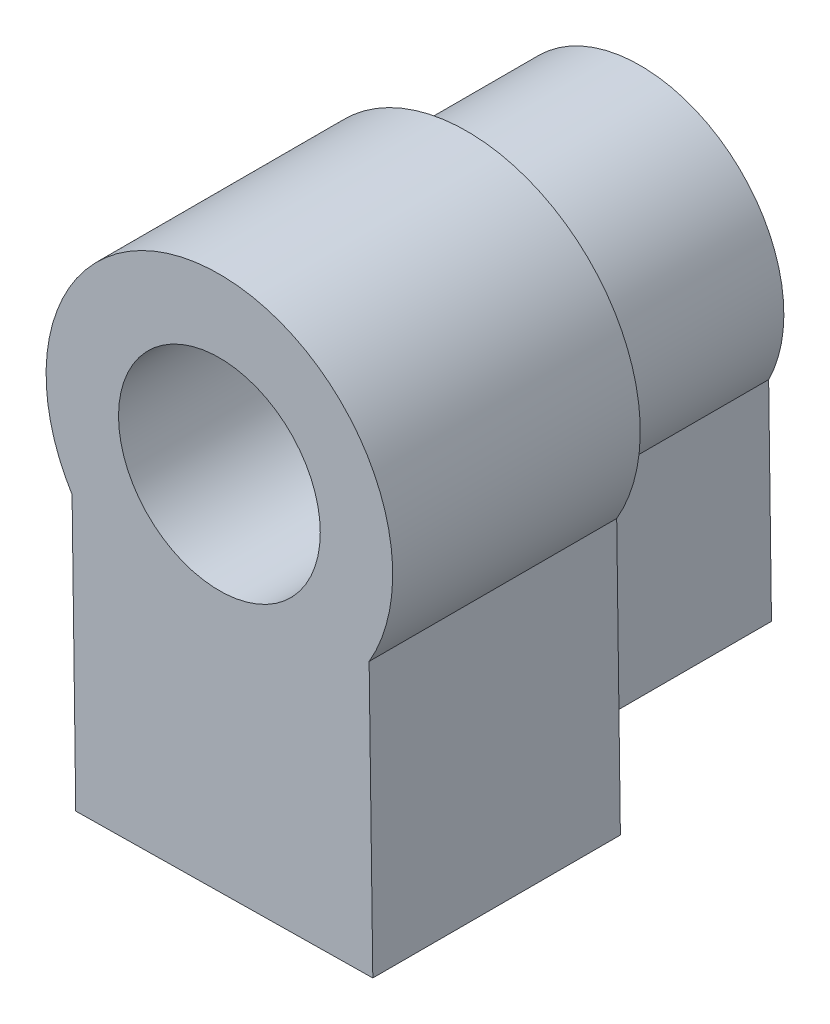
ISO-10303-21;
HEADER;
FILE_DESCRIPTION(('STEP AP214'),'2;1');
FILE_NAME('part.step','',(''),(''),'','','');
FILE_SCHEMA(('AUTOMOTIVE_DESIGN { 1 0 10303 214 1 1 1 1 }'));
ENDSEC;
DATA;
#1=APPLICATION_CONTEXT('core data for automotive mechanical design processes');
#2=APPLICATION_PROTOCOL_DEFINITION('international standard','automotive_design',2000,#1);
#3=PRODUCT_CONTEXT('',#1,'mechanical');
#4=PRODUCT('Part','Part','',(#3));
#5=PRODUCT_RELATED_PRODUCT_CATEGORY('part','',(#4));
#6=PRODUCT_DEFINITION_FORMATION('','',#4);
#7=PRODUCT_DEFINITION_CONTEXT('part definition',#1,'design');
#8=PRODUCT_DEFINITION('design','',#6,#7);
#9=PRODUCT_DEFINITION_SHAPE('','',#8);
#10=(LENGTH_UNIT() NAMED_UNIT(*) SI_UNIT(.MILLI.,.METRE.));
#11=(NAMED_UNIT(*) PLANE_ANGLE_UNIT() SI_UNIT($,.RADIAN.));
#12=(NAMED_UNIT(*) SI_UNIT($,.STERADIAN.) SOLID_ANGLE_UNIT());
#13=UNCERTAINTY_MEASURE_WITH_UNIT(LENGTH_MEASURE(1.E-05),#10,'distance_accuracy_value','');
#14=(GEOMETRIC_REPRESENTATION_CONTEXT(3) GLOBAL_UNCERTAINTY_ASSIGNED_CONTEXT((#13)) GLOBAL_UNIT_ASSIGNED_CONTEXT((#10,
#11,#12)) REPRESENTATION_CONTEXT('',''));
#15=CARTESIAN_POINT('',(0.,0.,0.));
#16=DIRECTION('',(0.,0.,1.));
#17=DIRECTION('',(1.,0.,0.));
#18=AXIS2_PLACEMENT_3D('',#15,#16,#17);
#19=CARTESIAN_POINT('',(4.98687572108652,0.0674471299078353,7.));
#20=DIRECTION('',(0.999908550721291,0.0135236901195044,0.));
#21=DIRECTION('',(-0.0135236901195044,0.999908550721291,0.));
#22=AXIS2_PLACEMENT_3D('',#19,#20,#21);
#23=PLANE('',#22);
#24=DIRECTION('',(0.0135236901195044,-0.999908550721291,0.));
#25=VECTOR('',#24,1.);
#26=CARTESIAN_POINT('',(4.98687572108652,0.0674471299078353,0.));
#27=LINE('',#26,#25);
#28=CARTESIAN_POINT('',(5.05045283259864,-4.63328890214981,0.));
#29=VERTEX_POINT('',#28);
#30=CARTESIAN_POINT('',(5.16406221909893,-13.0332889021498,0.));
#31=VERTEX_POINT('',#30);
#32=EDGE_CURVE('E117',#29,#31,#27,.T.);
#33=ORIENTED_EDGE('',*,*,#32,.F.);
#34=DIRECTION('',(0.,0.,-1.));
#35=VECTOR('',#34,1.);
#36=CARTESIAN_POINT('',(5.05045283259864,-4.63328890214981,7.));
#37=LINE('',#36,#35);
#38=CARTESIAN_POINT('',(5.05045283259864,-4.63328890214981,7.));
#39=VERTEX_POINT('',#38);
#40=EDGE_CURVE('E45',#39,#29,#37,.T.);
#41=ORIENTED_EDGE('',*,*,#40,.F.);
#42=DIRECTION('',(0.0135236901195044,-0.999908550721291,0.));
#43=VECTOR('',#42,1.);
#44=CARTESIAN_POINT('',(4.98687572108652,0.0674471299078353,7.));
#45=LINE('',#44,#43);
#46=CARTESIAN_POINT('',(5.16406221909893,-13.0332889021498,7.));
#47=VERTEX_POINT('',#46);
#48=EDGE_CURVE('E157',#39,#47,#45,.T.);
#49=ORIENTED_EDGE('',*,*,#48,.T.);
#50=DIRECTION('',(0.,0.,-1.));
#51=VECTOR('',#50,1.);
#52=CARTESIAN_POINT('',(5.16406221909893,-13.0332889021498,7.));
#53=LINE('',#52,#51);
#54=EDGE_CURVE('E75',#47,#31,#53,.T.);
#55=ORIENTED_EDGE('',*,*,#54,.T.);
#56=EDGE_LOOP('',(#33,#41,#49,#55));
#57=FACE_BOUND('',#56,.T.);
#58=ADVANCED_FACE('F37',(#57),#23,.T.);
#59=CARTESIAN_POINT('',(-0.135614238952738,-2.03623127295278,7.));
#60=DIRECTION('',(0.,0.,-1.));
#61=DIRECTION('',(-1.,0.,0.));
#62=AXIS2_PLACEMENT_3D('',#59,#60,#61);
#63=CYLINDRICAL_SURFACE('',#62,5.8);
#64=CARTESIAN_POINT('',(-0.135614238952738,-2.03623127295278,0.));
#65=DIRECTION('',(0.,0.,1.));
#66=DIRECTION('',(1.,0.,0.));
#67=AXIS2_PLACEMENT_3D('',#64,#65,#66);
#68=CIRCLE('',#67,5.8);
#69=CARTESIAN_POINT('',(-5.24954716740136,-4.77259564988231,0.));
#70=VERTEX_POINT('',#69);
#71=EDGE_CURVE('E171',#29,#70,#68,.T.);
#72=ORIENTED_EDGE('',*,*,#71,.T.);
#73=DIRECTION('',(0.,0.,-1.));
#74=VECTOR('',#73,1.);
#75=CARTESIAN_POINT('',(-5.24954716740136,-4.77259564988231,7.));
#76=LINE('',#75,#74);
#77=CARTESIAN_POINT('',(-5.24954716740136,-4.77259564988231,7.));
#78=VERTEX_POINT('',#77);
#79=EDGE_CURVE('E177',#78,#70,#76,.T.);
#80=ORIENTED_EDGE('',*,*,#79,.F.);
#81=CARTESIAN_POINT('',(-0.135614238952738,-2.03623127295278,7.));
#82=DIRECTION('',(0.,0.,1.));
#83=DIRECTION('',(1.,0.,0.));
#84=AXIS2_PLACEMENT_3D('',#81,#82,#83);
#85=CIRCLE('',#84,5.8);
#86=EDGE_CURVE('E159',#39,#78,#85,.T.);
#87=ORIENTED_EDGE('',*,*,#86,.F.);
#88=ORIENTED_EDGE('',*,*,#40,.T.);
#89=EDGE_LOOP('',(#72,#80,#87,#88));
#90=FACE_BOUND('',#89,.T.);
#91=ADVANCED_FACE('F180',(#90),#63,.T.);
#92=CARTESIAN_POINT('',(-5.31312427891349,-0.0718596178246598,7.));
#93=DIRECTION('',(0.999908550721291,0.0135236901195044,0.));
#94=DIRECTION('',(-0.0135236901195044,0.999908550721291,0.));
#95=AXIS2_PLACEMENT_3D('',#92,#93,#94);
#96=PLANE('',#95);
#97=DIRECTION('',(0.0135236901195044,-0.999908550721291,0.));
#98=VECTOR('',#97,1.);
#99=CARTESIAN_POINT('',(-5.31312427891349,-0.0718596178246598,0.));
#100=LINE('',#99,#98);
#101=CARTESIAN_POINT('',(-5.13593778090107,-13.1725956498823,0.));
#102=VERTEX_POINT('',#101);
#103=EDGE_CURVE('E69',#70,#102,#100,.T.);
#104=ORIENTED_EDGE('',*,*,#103,.T.);
#105=DIRECTION('',(0.,0.,-1.));
#106=VECTOR('',#105,1.);
#107=CARTESIAN_POINT('',(-5.13593778090107,-13.1725956498823,7.));
#108=LINE('',#107,#106);
#109=CARTESIAN_POINT('',(-5.13593778090107,-13.1725956498823,7.));
#110=VERTEX_POINT('',#109);
#111=EDGE_CURVE('E53',#110,#102,#108,.T.);
#112=ORIENTED_EDGE('',*,*,#111,.F.);
#113=DIRECTION('',(0.0135236901195044,-0.999908550721291,0.));
#114=VECTOR('',#113,1.);
#115=CARTESIAN_POINT('',(-5.31312427891349,-0.0718596178246598,7.));
#116=LINE('',#115,#114);
#117=EDGE_CURVE('E163',#78,#110,#116,.T.);
#118=ORIENTED_EDGE('',*,*,#117,.F.);
#119=ORIENTED_EDGE('',*,*,#79,.T.);
#120=EDGE_LOOP('',(#104,#112,#118,#119));
#121=FACE_BOUND('',#120,.T.);
#122=ADVANCED_FACE('F189',(#121),#96,.F.);
#123=CARTESIAN_POINT('',(0.177186498012413,-13.1007360320577,7.));
#124=DIRECTION('',(-0.0135236901195044,0.999908550721291,0.));
#125=DIRECTION('',(-0.999908550721291,-0.0135236901195044,0.));
#126=AXIS2_PLACEMENT_3D('',#123,#124,#125);
#127=PLANE('',#126);
#128=DIRECTION('',(0.999908550721291,0.0135236901195044,0.));
#129=VECTOR('',#128,1.);
#130=CARTESIAN_POINT('',(0.177186498012413,-13.1007360320577,0.));
#131=LINE('',#130,#129);
#132=EDGE_CURVE('E160',#102,#31,#131,.T.);
#133=ORIENTED_EDGE('',*,*,#132,.T.);
#134=ORIENTED_EDGE('',*,*,#54,.F.);
#135=DIRECTION('',(0.999908550721291,0.0135236901195044,0.));
#136=VECTOR('',#135,1.);
#137=CARTESIAN_POINT('',(0.177186498012413,-13.1007360320577,7.));
#138=LINE('',#137,#136);
#139=EDGE_CURVE('E166',#110,#47,#138,.T.);
#140=ORIENTED_EDGE('',*,*,#139,.F.);
#141=ORIENTED_EDGE('',*,*,#111,.T.);
#142=EDGE_LOOP('',(#133,#134,#140,#141));
#143=FACE_BOUND('',#142,.T.);
#144=ADVANCED_FACE('F193',(#143),#127,.F.);
#145=CARTESIAN_POINT('',(0.,0.,0.));
#146=DIRECTION('',(0.,0.,1.));
#147=DIRECTION('',(1.,0.,0.));
#148=AXIS2_PLACEMENT_3D('',#145,#146,#147);
#149=PLANE('',#148);
#150=ORIENTED_EDGE('',*,*,#32,.T.);
#151=ORIENTED_EDGE('',*,*,#132,.F.);
#152=ORIENTED_EDGE('',*,*,#103,.F.);
#153=ORIENTED_EDGE('',*,*,#71,.F.);
#154=EDGE_LOOP('',(#150,#151,#152,#153));
#155=FACE_BOUND('',#154,.T.);
#156=ADVANCED_FACE('F183',(#155),#149,.F.);
#157=CARTESIAN_POINT('',(5.83632702541427,0.0789358967585737,17.));
#158=DIRECTION('',(0.999908550721291,0.0135236901194974,0.));
#159=DIRECTION('',(-0.0135236901194974,0.999908550721291,0.));
#160=AXIS2_PLACEMENT_3D('',#157,#158,#159);
#161=PLANE('',#160);
#162=DIRECTION('',(0.0135236901194974,-0.999908550721291,0.));
#163=VECTOR('',#162,1.);
#164=CARTESIAN_POINT('',(5.83632702541427,0.0789358967585737,7.));
#165=LINE('',#164,#163);
#166=CARTESIAN_POINT('',(5.91259742353434,-5.5603106826363,7.));
#167=VERTEX_POINT('',#166);
#168=CARTESIAN_POINT('',(6.06137162014178,-16.5603106826363,7.));
#169=VERTEX_POINT('',#168);
#170=EDGE_CURVE('E114',#167,#169,#165,.T.);
#171=ORIENTED_EDGE('',*,*,#170,.F.);
#172=DIRECTION('',(0.,0.,-1.));
#173=VECTOR('',#172,1.);
#174=CARTESIAN_POINT('',(5.91259742353434,-5.5603106826363,17.));
#175=LINE('',#174,#173);
#176=CARTESIAN_POINT('',(5.91259742353434,-5.5603106826363,17.));
#177=VERTEX_POINT('',#176);
#178=EDGE_CURVE('E107',#177,#167,#175,.T.);
#179=ORIENTED_EDGE('',*,*,#178,.F.);
#180=DIRECTION('',(0.0135236901194974,-0.999908550721291,0.));
#181=VECTOR('',#180,1.);
#182=CARTESIAN_POINT('',(5.83632702541427,0.0789358967585737,17.));
#183=LINE('',#182,#181);
#184=CARTESIAN_POINT('',(6.06137162014178,-16.5603106826363,17.));
#185=VERTEX_POINT('',#184);
#186=EDGE_CURVE('E111',#177,#185,#183,.T.);
#187=ORIENTED_EDGE('',*,*,#186,.T.);
#188=DIRECTION('',(0.,0.,-1.));
#189=VECTOR('',#188,1.);
#190=CARTESIAN_POINT('',(6.06137162014178,-16.5603106826363,17.));
#191=LINE('',#190,#189);
#192=EDGE_CURVE('E146',#185,#169,#191,.T.);
#193=ORIENTED_EDGE('',*,*,#192,.T.);
#194=EDGE_LOOP('',(#171,#179,#187,#193));
#195=FACE_BOUND('',#194,.T.);
#196=ADVANCED_FACE('F109',(#195),#161,.T.);
#197=CARTESIAN_POINT('',(-0.135614238952738,-2.03623127295278,17.));
#198=DIRECTION('',(0.,0.,-1.));
#199=DIRECTION('',(-1.,0.,0.));
#200=AXIS2_PLACEMENT_3D('',#197,#198,#199);
#201=CYLINDRICAL_SURFACE('',#200,7.);
#202=CARTESIAN_POINT('',(-0.135614238952738,-2.03623127295278,7.));
#203=DIRECTION('',(0.,0.,1.));
#204=DIRECTION('',(1.,0.,0.));
#205=AXIS2_PLACEMENT_3D('',#202,#203,#204);
#206=CIRCLE('',#205,7.);
#207=CARTESIAN_POINT('',(-6.08630518512115,-5.72259496407026,7.));
#208=VERTEX_POINT('',#207);
#209=EDGE_CURVE('E148',#167,#208,#206,.T.);
#210=ORIENTED_EDGE('',*,*,#209,.T.);
#211=DIRECTION('',(0.,0.,-1.));
#212=VECTOR('',#211,1.);
#213=CARTESIAN_POINT('',(-6.08630518512115,-5.72259496407026,17.));
#214=LINE('',#213,#212);
#215=CARTESIAN_POINT('',(-6.08630518512115,-5.72259496407026,17.));
#216=VERTEX_POINT('',#215);
#217=EDGE_CURVE('E118',#216,#208,#214,.T.);
#218=ORIENTED_EDGE('',*,*,#217,.F.);
#219=CARTESIAN_POINT('',(-0.135614238952738,-2.03623127295278,17.));
#220=DIRECTION('',(0.,0.,1.));
#221=DIRECTION('',(1.,0.,0.));
#222=AXIS2_PLACEMENT_3D('',#219,#220,#221);
#223=CIRCLE('',#222,7.);
#224=EDGE_CURVE('E121',#177,#216,#223,.T.);
#225=ORIENTED_EDGE('',*,*,#224,.F.);
#226=ORIENTED_EDGE('',*,*,#178,.T.);
#227=EDGE_LOOP('',(#210,#218,#225,#226));
#228=FACE_BOUND('',#227,.T.);
#229=ADVANCED_FACE('F122',(#228),#201,.T.);
#230=CARTESIAN_POINT('',(-6.16257558324121,-0.0833483846753965,17.));
#231=DIRECTION('',(0.999908550721291,0.0135236901194976,0.));
#232=DIRECTION('',(-0.0135236901194976,0.999908550721291,0.));
#233=AXIS2_PLACEMENT_3D('',#230,#231,#232);
#234=PLANE('',#233);
#235=DIRECTION('',(0.0135236901194976,-0.999908550721291,0.));
#236=VECTOR('',#235,1.);
#237=CARTESIAN_POINT('',(-6.16257558324121,-0.0833483846753965,7.));
#238=LINE('',#237,#236);
#239=CARTESIAN_POINT('',(-5.9375309885137,-16.7225949640703,7.));
#240=VERTEX_POINT('',#239);
#241=EDGE_CURVE('E135',#208,#240,#238,.T.);
#242=ORIENTED_EDGE('',*,*,#241,.T.);
#243=DIRECTION('',(0.,0.,-1.));
#244=VECTOR('',#243,1.);
#245=CARTESIAN_POINT('',(-5.9375309885137,-16.7225949640703,17.));
#246=LINE('',#245,#244);
#247=CARTESIAN_POINT('',(-5.9375309885137,-16.7225949640703,17.));
#248=VERTEX_POINT('',#247);
#249=EDGE_CURVE('E154',#248,#240,#246,.T.);
#250=ORIENTED_EDGE('',*,*,#249,.F.);
#251=DIRECTION('',(0.0135236901194976,-0.999908550721291,0.));
#252=VECTOR('',#251,1.);
#253=CARTESIAN_POINT('',(-6.16257558324121,-0.0833483846753965,17.));
#254=LINE('',#253,#252);
#255=EDGE_CURVE('E126',#216,#248,#254,.T.);
#256=ORIENTED_EDGE('',*,*,#255,.F.);
#257=ORIENTED_EDGE('',*,*,#217,.T.);
#258=EDGE_LOOP('',(#242,#250,#256,#257));
#259=FACE_BOUND('',#258,.T.);
#260=ADVANCED_FACE('F211',(#259),#234,.F.);
#261=CARTESIAN_POINT('',(0.225044594727508,-16.6392465793949,17.));
#262=DIRECTION('',(0.0135236901194974,-0.999908550721291,0.));
#263=DIRECTION('',(0.999908550721291,0.0135236901194974,0.));
#264=AXIS2_PLACEMENT_3D('',#261,#262,#263);
#265=PLANE('',#264);
#266=CARTESIAN_POINT('',(-0.0160965838409271,-16.6425079962231,13.));
#267=DIRECTION('',(0.0135236901194975,-0.999908550721291,0.));
#268=DIRECTION('',(0.999908550721291,0.0135236901194975,0.));
#269=AXIS2_PLACEMENT_3D('',#266,#267,#268);
#270=CIRCLE('',#269,1.35);
#271=CARTESIAN_POINT('',(1.33377995963282,-16.6242510145618,13.));
#272=VERTEX_POINT('',#271);
#273=EDGE_CURVE('E138',#272,#272,#270,.T.);
#274=ORIENTED_EDGE('',*,*,#273,.F.);
#275=EDGE_LOOP('',(#274));
#276=FACE_BOUND('',#275,.T.);
#277=DIRECTION('',(-0.999908550721291,-0.0135236901194974,0.));
#278=VECTOR('',#277,1.);
#279=CARTESIAN_POINT('',(0.225044594727508,-16.6392465793949,7.));
#280=LINE('',#279,#278);
#281=EDGE_CURVE('E132',#169,#240,#280,.T.);
#282=ORIENTED_EDGE('',*,*,#281,.F.);
#283=ORIENTED_EDGE('',*,*,#192,.F.);
#284=DIRECTION('',(-0.999908550721291,-0.0135236901194974,0.));
#285=VECTOR('',#284,1.);
#286=CARTESIAN_POINT('',(0.225044594727508,-16.6392465793949,17.));
#287=LINE('',#286,#285);
#288=EDGE_CURVE('E131',#185,#248,#287,.T.);
#289=ORIENTED_EDGE('',*,*,#288,.T.);
#290=ORIENTED_EDGE('',*,*,#249,.T.);
#291=EDGE_LOOP('',(#282,#283,#289,#290));
#292=FACE_BOUND('',#291,.T.);
#293=ADVANCED_FACE('F214',(#276,#292),#265,.T.);
#294=CARTESIAN_POINT('',(-0.135614238952738,-2.03623127295278,17.));
#295=DIRECTION('',(0.,0.,-1.));
#296=DIRECTION('',(-1.,0.,0.));
#297=AXIS2_PLACEMENT_3D('',#294,#295,#296);
#298=CYLINDRICAL_SURFACE('',#297,4.075);
#299=CARTESIAN_POINT('',(-0.135614238952738,-2.03623127295278,17.));
#300=DIRECTION('',(0.,0.,1.));
#301=DIRECTION('',(1.,0.,0.));
#302=AXIS2_PLACEMENT_3D('',#299,#300,#301);
#303=CIRCLE('',#302,4.075);
#304=CARTESIAN_POINT('',(3.93938576104726,-2.03623127295278,17.));
#305=VERTEX_POINT('',#304);
#306=EDGE_CURVE('E143',#305,#305,#303,.T.);
#307=ORIENTED_EDGE('',*,*,#306,.T.);
#308=EDGE_LOOP('',(#307));
#309=FACE_BOUND('',#308,.T.);
#310=CARTESIAN_POINT('',(-0.135614238952738,-2.03623127295278,7.));
#311=DIRECTION('',(0.,0.,1.));
#312=DIRECTION('',(1.,0.,0.));
#313=AXIS2_PLACEMENT_3D('',#310,#311,#312);
#314=CIRCLE('',#313,4.075);
#315=CARTESIAN_POINT('',(3.93938576104726,-2.03623127295278,7.));
#316=VERTEX_POINT('',#315);
#317=EDGE_CURVE('E11',#316,#316,#314,.F.);
#318=ORIENTED_EDGE('',*,*,#317,.T.);
#319=EDGE_LOOP('',(#318));
#320=FACE_BOUND('',#319,.T.);
#321=ADVANCED_FACE('F218',(#309,#320),#298,.F.);
#322=CARTESIAN_POINT('',(0.,0.,17.));
#323=DIRECTION('',(0.,0.,1.));
#324=DIRECTION('',(1.,0.,0.));
#325=AXIS2_PLACEMENT_3D('',#322,#323,#324);
#326=PLANE('',#325);
#327=ORIENTED_EDGE('',*,*,#186,.F.);
#328=ORIENTED_EDGE('',*,*,#224,.T.);
#329=ORIENTED_EDGE('',*,*,#255,.T.);
#330=ORIENTED_EDGE('',*,*,#288,.F.);
#331=EDGE_LOOP('',(#327,#328,#329,#330));
#332=FACE_BOUND('',#331,.T.);
#333=ORIENTED_EDGE('',*,*,#306,.F.);
#334=EDGE_LOOP('',(#333));
#335=FACE_BOUND('',#334,.T.);
#336=ADVANCED_FACE('F128',(#332,#335),#326,.T.);
#337=CARTESIAN_POINT('',(0.,0.,7.));
#338=DIRECTION('',(0.,0.,1.));
#339=DIRECTION('',(1.,0.,0.));
#340=AXIS2_PLACEMENT_3D('',#337,#338,#339);
#341=PLANE('',#340);
#342=ORIENTED_EDGE('',*,*,#48,.F.);
#343=ORIENTED_EDGE('',*,*,#86,.T.);
#344=ORIENTED_EDGE('',*,*,#117,.T.);
#345=ORIENTED_EDGE('',*,*,#139,.T.);
#346=EDGE_LOOP('',(#342,#343,#344,#345));
#347=FACE_BOUND('',#346,.T.);
#348=ORIENTED_EDGE('',*,*,#170,.T.);
#349=ORIENTED_EDGE('',*,*,#281,.T.);
#350=ORIENTED_EDGE('',*,*,#241,.F.);
#351=ORIENTED_EDGE('',*,*,#209,.F.);
#352=EDGE_LOOP('',(#348,#349,#350,#351));
#353=FACE_BOUND('',#352,.T.);
#354=ADVANCED_FACE('F205',(#347,#353),#341,.F.);
#355=CARTESIAN_POINT('',(0.,0.,7.));
#356=DIRECTION('',(0.,0.,1.));
#357=DIRECTION('',(1.,0.,0.));
#358=AXIS2_PLACEMENT_3D('',#355,#356,#357);
#359=PLANE('',#358);
#360=ORIENTED_EDGE('',*,*,#317,.F.);
#361=EDGE_LOOP('',(#360));
#362=FACE_BOUND('',#361,.T.);
#363=ADVANCED_FACE('F201',(#362),#359,.T.);
#364=CARTESIAN_POINT('',(-0.131047949856656,-8.14328531509213,13.));
#365=DIRECTION('',(0.0135236901194975,-0.99990855072129,0.));
#366=DIRECTION('',(0.999908550721291,0.0135236901194975,0.));
#367=AXIS2_PLACEMENT_3D('',#364,#365,#366);
#368=CYLINDRICAL_SURFACE('',#367,1.35);
#369=CARTESIAN_POINT('',(-0.131047949856656,-8.14328531509213,13.));
#370=DIRECTION('',(0.0135236901194975,-0.999908550721291,0.));
#371=DIRECTION('',(0.999908550721291,0.0135236901194975,0.));
#372=AXIS2_PLACEMENT_3D('',#369,#370,#371);
#373=CIRCLE('',#372,1.35);
#374=CARTESIAN_POINT('',(1.21882859361709,-8.12502833343081,13.));
#375=VERTEX_POINT('',#374);
#376=EDGE_CURVE('E149',#375,#375,#373,.T.);
#377=ORIENTED_EDGE('',*,*,#376,.F.);
#378=EDGE_LOOP('',(#377));
#379=FACE_BOUND('',#378,.T.);
#380=ORIENTED_EDGE('',*,*,#273,.T.);
#381=EDGE_LOOP('',(#380));
#382=FACE_BOUND('',#381,.T.);
#383=ADVANCED_FACE('F204',(#379,#382),#368,.F.);
#384=CARTESIAN_POINT('',(-0.131047949856656,-8.14328531509213,13.));
#385=DIRECTION('',(0.0135236901194975,-0.999908550721291,0.));
#386=DIRECTION('',(0.999908550721291,0.0135236901194975,0.));
#387=AXIS2_PLACEMENT_3D('',#384,#385,#386);
#388=PLANE('',#387);
#389=ORIENTED_EDGE('',*,*,#376,.T.);
#390=EDGE_LOOP('',(#389));
#391=FACE_BOUND('',#390,.T.);
#392=ADVANCED_FACE('F230',(#391),#388,.T.);
#393=CLOSED_SHELL('',(#58,#91,#122,#144,#156,#196,#229,#260,#293,#321,#336,#354,#363,#383,#392));
#394=MANIFOLD_SOLID_BREP('B2',#393);
#395=ADVANCED_BREP_SHAPE_REPRESENTATION('',(#18,#394),#14);
#396=SHAPE_DEFINITION_REPRESENTATION(#9,#395);
ENDSEC;
END-ISO-10303-21;
